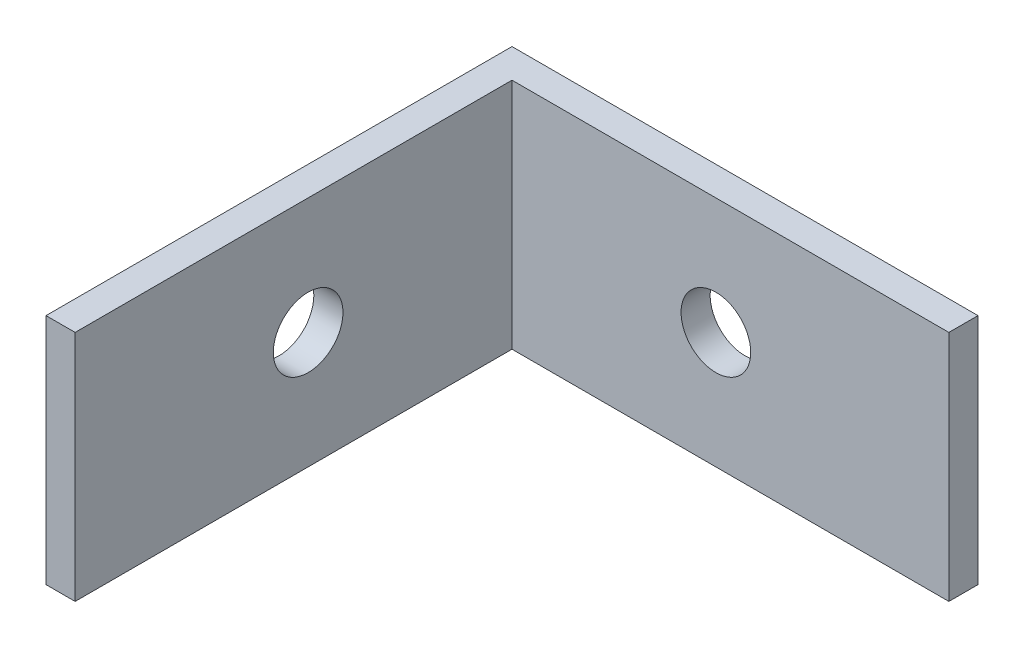
ISO-10303-21;
HEADER;
FILE_DESCRIPTION(('STEP AP214'),'2;1');
FILE_NAME('part.step','',(''),(''),'','','');
FILE_SCHEMA(('AUTOMOTIVE_DESIGN { 1 0 10303 214 1 1 1 1 }'));
ENDSEC;
DATA;
#1=APPLICATION_CONTEXT('core data for automotive mechanical design processes');
#2=APPLICATION_PROTOCOL_DEFINITION('international standard','automotive_design',2000,#1);
#3=PRODUCT_CONTEXT('',#1,'mechanical');
#4=PRODUCT('Part','Part','',(#3));
#5=PRODUCT_RELATED_PRODUCT_CATEGORY('part','',(#4));
#6=PRODUCT_DEFINITION_FORMATION('','',#4);
#7=PRODUCT_DEFINITION_CONTEXT('part definition',#1,'design');
#8=PRODUCT_DEFINITION('design','',#6,#7);
#9=PRODUCT_DEFINITION_SHAPE('','',#8);
#10=(LENGTH_UNIT() NAMED_UNIT(*) SI_UNIT(.MILLI.,.METRE.));
#11=(NAMED_UNIT(*) PLANE_ANGLE_UNIT() SI_UNIT($,.RADIAN.));
#12=(NAMED_UNIT(*) SI_UNIT($,.STERADIAN.) SOLID_ANGLE_UNIT());
#13=UNCERTAINTY_MEASURE_WITH_UNIT(LENGTH_MEASURE(1.E-05),#10,'distance_accuracy_value','');
#14=(GEOMETRIC_REPRESENTATION_CONTEXT(3) GLOBAL_UNCERTAINTY_ASSIGNED_CONTEXT((#13)) GLOBAL_UNIT_ASSIGNED_CONTEXT((#10,
#11,#12)) REPRESENTATION_CONTEXT('',''));
#15=CARTESIAN_POINT('',(0.,0.,0.));
#16=DIRECTION('',(0.,0.,1.));
#17=DIRECTION('',(1.,0.,0.));
#18=AXIS2_PLACEMENT_3D('',#15,#16,#17);
#19=CARTESIAN_POINT('',(1.5875,12.7,-18.5573275862069));
#20=DIRECTION('',(-1.,0.,0.));
#21=DIRECTION('',(0.,0.,1.));
#22=AXIS2_PLACEMENT_3D('',#19,#20,#21);
#23=PLANE('',#22);
#24=DIRECTION('',(0.,0.,-1.));
#25=VECTOR('',#24,1.);
#26=CARTESIAN_POINT('',(1.5875,0.,-18.5573275862069));
#27=LINE('',#26,#25);
#28=CARTESIAN_POINT('',(1.5875,0.,5.2551724137931));
#29=VERTEX_POINT('',#28);
#30=CARTESIAN_POINT('',(1.5875,0.,-18.5573275862069));
#31=VERTEX_POINT('',#30);
#32=EDGE_CURVE('E122',#29,#31,#27,.T.);
#33=ORIENTED_EDGE('',*,*,#32,.T.);
#34=DIRECTION('',(0.,-1.,0.));
#35=VECTOR('',#34,1.);
#36=CARTESIAN_POINT('',(1.5875,12.7,-18.5573275862069));
#37=LINE('',#36,#35);
#38=CARTESIAN_POINT('',(1.5875,12.7,-18.5573275862069));
#39=VERTEX_POINT('',#38);
#40=EDGE_CURVE('E43',#39,#31,#37,.T.);
#41=ORIENTED_EDGE('',*,*,#40,.F.);
#42=DIRECTION('',(0.,0.,-1.));
#43=VECTOR('',#42,1.);
#44=CARTESIAN_POINT('',(1.5875,12.7,-18.5573275862069));
#45=LINE('',#44,#43);
#46=CARTESIAN_POINT('',(1.5875,12.7,5.2551724137931));
#47=VERTEX_POINT('',#46);
#48=EDGE_CURVE('E88',#47,#39,#45,.T.);
#49=ORIENTED_EDGE('',*,*,#48,.F.);
#50=DIRECTION('',(0.,-1.,0.));
#51=VECTOR('',#50,1.);
#52=CARTESIAN_POINT('',(1.5875,12.7,5.2551724137931));
#53=LINE('',#52,#51);
#54=EDGE_CURVE('E11',#47,#29,#53,.T.);
#55=ORIENTED_EDGE('',*,*,#54,.T.);
#56=EDGE_LOOP('',(#33,#41,#49,#55));
#57=FACE_BOUND('',#56,.T.);
#58=CARTESIAN_POINT('',(1.5875,6.35,-7.4448275862069));
#59=DIRECTION('',(1.,0.,0.));
#60=DIRECTION('',(0.,0.,-1.));
#61=AXIS2_PLACEMENT_3D('',#58,#59,#60);
#62=CIRCLE('',#61,1.89864999999999);
#63=CARTESIAN_POINT('',(1.5875,6.35,-9.34347758620688));
#64=VERTEX_POINT('',#63);
#65=EDGE_CURVE('E226',#64,#64,#62,.T.);
#66=ORIENTED_EDGE('',*,*,#65,.F.);
#67=EDGE_LOOP('',(#66));
#68=FACE_BOUND('',#67,.T.);
#69=ADVANCED_FACE('F34',(#57,#68),#23,.F.);
#70=CARTESIAN_POINT('',(1.5875,12.7,5.2551724137931));
#71=DIRECTION('',(0.,0.,-1.));
#72=DIRECTION('',(-1.,0.,0.));
#73=AXIS2_PLACEMENT_3D('',#70,#71,#72);
#74=PLANE('',#73);
#75=DIRECTION('',(1.,0.,0.));
#76=VECTOR('',#75,1.);
#77=CARTESIAN_POINT('',(1.5875,0.,5.2551724137931));
#78=LINE('',#77,#76);
#79=CARTESIAN_POINT('',(0.,0.,5.2551724137931));
#80=VERTEX_POINT('',#79);
#81=EDGE_CURVE('E119',#80,#29,#78,.T.);
#82=ORIENTED_EDGE('',*,*,#81,.T.);
#83=ORIENTED_EDGE('',*,*,#54,.F.);
#84=DIRECTION('',(1.,0.,0.));
#85=VECTOR('',#84,1.);
#86=CARTESIAN_POINT('',(1.5875,12.7,5.2551724137931));
#87=LINE('',#86,#85);
#88=CARTESIAN_POINT('',(0.,12.7,5.2551724137931));
#89=VERTEX_POINT('',#88);
#90=EDGE_CURVE('E130',#89,#47,#87,.T.);
#91=ORIENTED_EDGE('',*,*,#90,.F.);
#92=DIRECTION('',(0.,-1.,0.));
#93=VECTOR('',#92,1.);
#94=CARTESIAN_POINT('',(0.,12.7,5.2551724137931));
#95=LINE('',#94,#93);
#96=EDGE_CURVE('E115',#89,#80,#95,.T.);
#97=ORIENTED_EDGE('',*,*,#96,.T.);
#98=EDGE_LOOP('',(#82,#83,#91,#97));
#99=FACE_BOUND('',#98,.T.);
#100=ADVANCED_FACE('F36',(#99),#74,.F.);
#101=CARTESIAN_POINT('',(25.4,12.7,-18.5573275862069));
#102=DIRECTION('',(0.,0.,-1.));
#103=DIRECTION('',(-1.,0.,0.));
#104=AXIS2_PLACEMENT_3D('',#101,#102,#103);
#105=PLANE('',#104);
#106=CARTESIAN_POINT('',(12.7,6.35,-18.5573275862069));
#107=DIRECTION('',(0.,0.,1.));
#108=DIRECTION('',(1.,0.,0.));
#109=AXIS2_PLACEMENT_3D('',#106,#107,#108);
#110=CIRCLE('',#109,1.89864999999999);
#111=CARTESIAN_POINT('',(14.59865,6.35,-18.5573275862069));
#112=VERTEX_POINT('',#111);
#113=EDGE_CURVE('E231',#112,#112,#110,.T.);
#114=ORIENTED_EDGE('',*,*,#113,.F.);
#115=EDGE_LOOP('',(#114));
#116=FACE_BOUND('',#115,.T.);
#117=DIRECTION('',(1.,0.,0.));
#118=VECTOR('',#117,1.);
#119=CARTESIAN_POINT('',(25.4,0.,-18.5573275862069));
#120=LINE('',#119,#118);
#121=CARTESIAN_POINT('',(25.4,0.,-18.5573275862069));
#122=VERTEX_POINT('',#121);
#123=EDGE_CURVE('E125',#31,#122,#120,.T.);
#124=ORIENTED_EDGE('',*,*,#123,.T.);
#125=DIRECTION('',(0.,-1.,0.));
#126=VECTOR('',#125,1.);
#127=CARTESIAN_POINT('',(25.4,12.7,-18.5573275862069));
#128=LINE('',#127,#126);
#129=CARTESIAN_POINT('',(25.4,12.7,-18.5573275862069));
#130=VERTEX_POINT('',#129);
#131=EDGE_CURVE('E110',#130,#122,#128,.T.);
#132=ORIENTED_EDGE('',*,*,#131,.F.);
#133=DIRECTION('',(1.,0.,0.));
#134=VECTOR('',#133,1.);
#135=CARTESIAN_POINT('',(25.4,12.7,-18.5573275862069));
#136=LINE('',#135,#134);
#137=EDGE_CURVE('E101',#39,#130,#136,.T.);
#138=ORIENTED_EDGE('',*,*,#137,.F.);
#139=ORIENTED_EDGE('',*,*,#40,.T.);
#140=EDGE_LOOP('',(#124,#132,#138,#139));
#141=FACE_BOUND('',#140,.T.);
#142=ADVANCED_FACE('F136',(#116,#141),#105,.F.);
#143=CARTESIAN_POINT('',(25.4,12.7,-20.1448275862069));
#144=DIRECTION('',(-1.,0.,0.));
#145=DIRECTION('',(0.,0.,1.));
#146=AXIS2_PLACEMENT_3D('',#143,#144,#145);
#147=PLANE('',#146);
#148=DIRECTION('',(0.,0.,-1.));
#149=VECTOR('',#148,1.);
#150=CARTESIAN_POINT('',(25.4,0.,-20.1448275862069));
#151=LINE('',#150,#149);
#152=CARTESIAN_POINT('',(25.4,0.,-20.1448275862069));
#153=VERTEX_POINT('',#152);
#154=EDGE_CURVE('E109',#122,#153,#151,.T.);
#155=ORIENTED_EDGE('',*,*,#154,.T.);
#156=DIRECTION('',(0.,-1.,0.));
#157=VECTOR('',#156,1.);
#158=CARTESIAN_POINT('',(25.4,12.7,-20.1448275862069));
#159=LINE('',#158,#157);
#160=CARTESIAN_POINT('',(25.4,12.7,-20.1448275862069));
#161=VERTEX_POINT('',#160);
#162=EDGE_CURVE('E106',#161,#153,#159,.T.);
#163=ORIENTED_EDGE('',*,*,#162,.F.);
#164=DIRECTION('',(0.,0.,-1.));
#165=VECTOR('',#164,1.);
#166=CARTESIAN_POINT('',(25.4,12.7,-20.1448275862069));
#167=LINE('',#166,#165);
#168=EDGE_CURVE('E95',#130,#161,#167,.T.);
#169=ORIENTED_EDGE('',*,*,#168,.F.);
#170=ORIENTED_EDGE('',*,*,#131,.T.);
#171=EDGE_LOOP('',(#155,#163,#169,#170));
#172=FACE_BOUND('',#171,.T.);
#173=ADVANCED_FACE('F107',(#172),#147,.F.);
#174=CARTESIAN_POINT('',(0.,12.7,-20.1448275862069));
#175=DIRECTION('',(0.,0.,1.));
#176=DIRECTION('',(1.,0.,0.));
#177=AXIS2_PLACEMENT_3D('',#174,#175,#176);
#178=PLANE('',#177);
#179=CARTESIAN_POINT('',(12.7,6.35,-20.1448275862069));
#180=DIRECTION('',(0.,0.,1.));
#181=DIRECTION('',(1.,0.,0.));
#182=AXIS2_PLACEMENT_3D('',#179,#180,#181);
#183=CIRCLE('',#182,1.89865);
#184=CARTESIAN_POINT('',(14.59865,6.35,-20.1448275862069));
#185=VERTEX_POINT('',#184);
#186=EDGE_CURVE('E227',#185,#185,#183,.T.);
#187=ORIENTED_EDGE('',*,*,#186,.T.);
#188=EDGE_LOOP('',(#187));
#189=FACE_BOUND('',#188,.T.);
#190=DIRECTION('',(-1.,0.,0.));
#191=VECTOR('',#190,1.);
#192=CARTESIAN_POINT('',(0.,0.,-20.1448275862069));
#193=LINE('',#192,#191);
#194=CARTESIAN_POINT('',(0.,0.,-20.1448275862069));
#195=VERTEX_POINT('',#194);
#196=EDGE_CURVE('E74',#153,#195,#193,.T.);
#197=ORIENTED_EDGE('',*,*,#196,.T.);
#198=DIRECTION('',(0.,-1.,0.));
#199=VECTOR('',#198,1.);
#200=CARTESIAN_POINT('',(0.,12.7,-20.1448275862069));
#201=LINE('',#200,#199);
#202=CARTESIAN_POINT('',(0.,12.7,-20.1448275862069));
#203=VERTEX_POINT('',#202);
#204=EDGE_CURVE('E111',#203,#195,#201,.T.);
#205=ORIENTED_EDGE('',*,*,#204,.F.);
#206=DIRECTION('',(-1.,0.,0.));
#207=VECTOR('',#206,1.);
#208=CARTESIAN_POINT('',(0.,12.7,-20.1448275862069));
#209=LINE('',#208,#207);
#210=EDGE_CURVE('E99',#161,#203,#209,.T.);
#211=ORIENTED_EDGE('',*,*,#210,.F.);
#212=ORIENTED_EDGE('',*,*,#162,.T.);
#213=EDGE_LOOP('',(#197,#205,#211,#212));
#214=FACE_BOUND('',#213,.T.);
#215=ADVANCED_FACE('F113',(#189,#214),#178,.F.);
#216=CARTESIAN_POINT('',(0.,12.7,5.2551724137931));
#217=DIRECTION('',(1.,0.,0.));
#218=DIRECTION('',(0.,0.,-1.));
#219=AXIS2_PLACEMENT_3D('',#216,#217,#218);
#220=PLANE('',#219);
#221=CARTESIAN_POINT('',(0.,6.35,-7.4448275862069));
#222=DIRECTION('',(1.,0.,0.));
#223=DIRECTION('',(0.,0.,-1.));
#224=AXIS2_PLACEMENT_3D('',#221,#222,#223);
#225=CIRCLE('',#224,1.89865);
#226=CARTESIAN_POINT('',(0.,6.35,-9.3434775862069));
#227=VERTEX_POINT('',#226);
#228=EDGE_CURVE('E123',#227,#227,#225,.T.);
#229=ORIENTED_EDGE('',*,*,#228,.T.);
#230=EDGE_LOOP('',(#229));
#231=FACE_BOUND('',#230,.T.);
#232=DIRECTION('',(0.,0.,1.));
#233=VECTOR('',#232,1.);
#234=CARTESIAN_POINT('',(0.,0.,5.2551724137931));
#235=LINE('',#234,#233);
#236=EDGE_CURVE('E80',#195,#80,#235,.T.);
#237=ORIENTED_EDGE('',*,*,#236,.T.);
#238=ORIENTED_EDGE('',*,*,#96,.F.);
#239=DIRECTION('',(0.,0.,1.));
#240=VECTOR('',#239,1.);
#241=CARTESIAN_POINT('',(0.,12.7,5.2551724137931));
#242=LINE('',#241,#240);
#243=EDGE_CURVE('E51',#203,#89,#242,.T.);
#244=ORIENTED_EDGE('',*,*,#243,.F.);
#245=ORIENTED_EDGE('',*,*,#204,.T.);
#246=EDGE_LOOP('',(#237,#238,#244,#245));
#247=FACE_BOUND('',#246,.T.);
#248=ADVANCED_FACE('F143',(#231,#247),#220,.F.);
#249=CARTESIAN_POINT('',(0.,12.7,0.));
#250=DIRECTION('',(0.,-1.,0.));
#251=DIRECTION('',(0.,0.,-1.));
#252=AXIS2_PLACEMENT_3D('',#249,#250,#251);
#253=PLANE('',#252);
#254=ORIENTED_EDGE('',*,*,#90,.T.);
#255=ORIENTED_EDGE('',*,*,#48,.T.);
#256=ORIENTED_EDGE('',*,*,#137,.T.);
#257=ORIENTED_EDGE('',*,*,#168,.T.);
#258=ORIENTED_EDGE('',*,*,#210,.T.);
#259=ORIENTED_EDGE('',*,*,#243,.T.);
#260=EDGE_LOOP('',(#254,#255,#256,#257,#258,#259));
#261=FACE_BOUND('',#260,.T.);
#262=ADVANCED_FACE('F97',(#261),#253,.F.);
#263=CARTESIAN_POINT('',(0.,0.,0.));
#264=DIRECTION('',(0.,-1.,0.));
#265=DIRECTION('',(0.,0.,-1.));
#266=AXIS2_PLACEMENT_3D('',#263,#264,#265);
#267=PLANE('',#266);
#268=ORIENTED_EDGE('',*,*,#81,.F.);
#269=ORIENTED_EDGE('',*,*,#236,.F.);
#270=ORIENTED_EDGE('',*,*,#196,.F.);
#271=ORIENTED_EDGE('',*,*,#154,.F.);
#272=ORIENTED_EDGE('',*,*,#123,.F.);
#273=ORIENTED_EDGE('',*,*,#32,.F.);
#274=EDGE_LOOP('',(#268,#269,#270,#271,#272,#273));
#275=FACE_BOUND('',#274,.T.);
#276=ADVANCED_FACE('F139',(#275),#267,.T.);
#277=CARTESIAN_POINT('',(1.5875,6.35,-7.4448275862069));
#278=DIRECTION('',(1.,0.,0.));
#279=DIRECTION('',(0.,0.,-1.));
#280=AXIS2_PLACEMENT_3D('',#277,#278,#279);
#281=CYLINDRICAL_SURFACE('',#280,1.89864999999999);
#282=ORIENTED_EDGE('',*,*,#228,.F.);
#283=EDGE_LOOP('',(#282));
#284=FACE_BOUND('',#283,.T.);
#285=ORIENTED_EDGE('',*,*,#65,.T.);
#286=EDGE_LOOP('',(#285));
#287=FACE_BOUND('',#286,.T.);
#288=ADVANCED_FACE('F189',(#284,#287),#281,.F.);
#289=CARTESIAN_POINT('',(12.7,6.35,-18.5573275862069));
#290=DIRECTION('',(0.,0.,1.));
#291=DIRECTION('',(1.,0.,0.));
#292=AXIS2_PLACEMENT_3D('',#289,#290,#291);
#293=CYLINDRICAL_SURFACE('',#292,1.89864999999999);
#294=ORIENTED_EDGE('',*,*,#186,.F.);
#295=EDGE_LOOP('',(#294));
#296=FACE_BOUND('',#295,.T.);
#297=ORIENTED_EDGE('',*,*,#113,.T.);
#298=EDGE_LOOP('',(#297));
#299=FACE_BOUND('',#298,.T.);
#300=ADVANCED_FACE('F185',(#296,#299),#293,.F.);
#301=CLOSED_SHELL('',(#69,#100,#142,#173,#215,#248,#262,#276,#288,#300));
#302=MANIFOLD_SOLID_BREP('B2',#301);
#303=ADVANCED_BREP_SHAPE_REPRESENTATION('',(#18,#302),#14);
#304=SHAPE_DEFINITION_REPRESENTATION(#9,#303);
ENDSEC;
END-ISO-10303-21;
